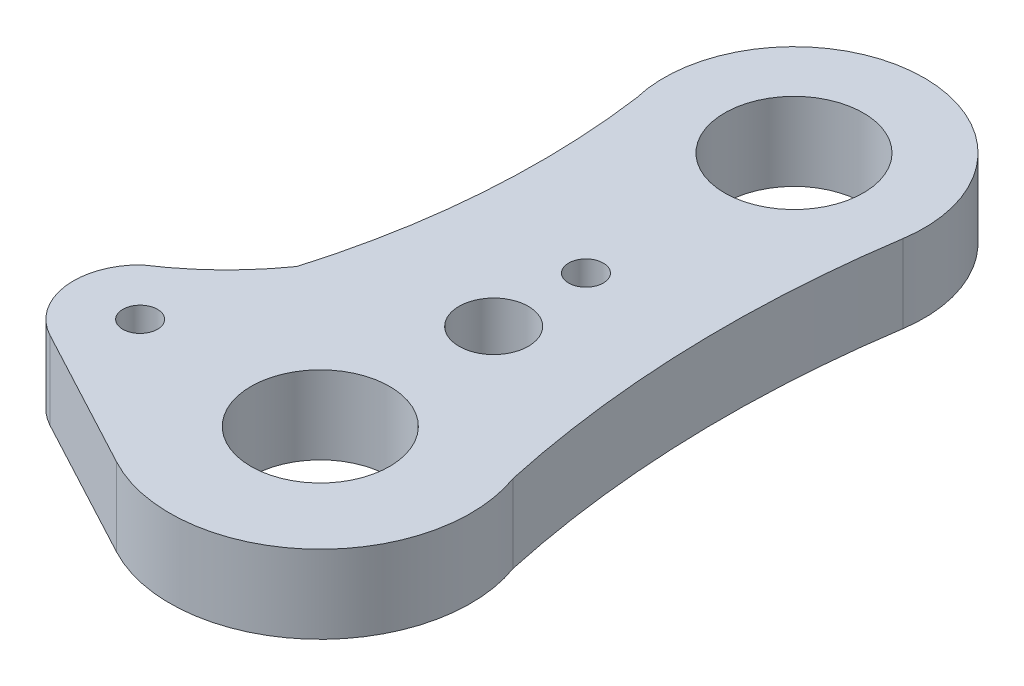
ISO-10303-21;
HEADER;
FILE_DESCRIPTION(('STEP AP214'),'2;1');
FILE_NAME('part.step','',(''),(''),'','','');
FILE_SCHEMA(('AUTOMOTIVE_DESIGN { 1 0 10303 214 1 1 1 1 }'));
ENDSEC;
DATA;
#1=APPLICATION_CONTEXT('core data for automotive mechanical design processes');
#2=APPLICATION_PROTOCOL_DEFINITION('international standard','automotive_design',2000,#1);
#3=PRODUCT_CONTEXT('',#1,'mechanical');
#4=PRODUCT('Part','Part','',(#3));
#5=PRODUCT_RELATED_PRODUCT_CATEGORY('part','',(#4));
#6=PRODUCT_DEFINITION_FORMATION('','',#4);
#7=PRODUCT_DEFINITION_CONTEXT('part definition',#1,'design');
#8=PRODUCT_DEFINITION('design','',#6,#7);
#9=PRODUCT_DEFINITION_SHAPE('','',#8);
#10=(LENGTH_UNIT() NAMED_UNIT(*) SI_UNIT(.MILLI.,.METRE.));
#11=(NAMED_UNIT(*) PLANE_ANGLE_UNIT() SI_UNIT($,.RADIAN.));
#12=(NAMED_UNIT(*) SI_UNIT($,.STERADIAN.) SOLID_ANGLE_UNIT());
#13=UNCERTAINTY_MEASURE_WITH_UNIT(LENGTH_MEASURE(1.E-05),#10,'distance_accuracy_value','');
#14=(GEOMETRIC_REPRESENTATION_CONTEXT(3) GLOBAL_UNCERTAINTY_ASSIGNED_CONTEXT((#13)) GLOBAL_UNIT_ASSIGNED_CONTEXT((#10,
#11,#12)) REPRESENTATION_CONTEXT('',''));
#15=CARTESIAN_POINT('',(0.,0.,0.));
#16=DIRECTION('',(0.,0.,1.));
#17=DIRECTION('',(1.,0.,0.));
#18=AXIS2_PLACEMENT_3D('',#15,#16,#17);
#19=CARTESIAN_POINT('',(-3.02396756935756E-08,4.5,-12.));
#20=DIRECTION('',(0.,-1.,0.));
#21=DIRECTION('',(0.,0.,-1.));
#22=AXIS2_PLACEMENT_3D('',#19,#20,#21);
#23=CYLINDRICAL_SURFACE('',#22,7.50754929042045);
#24=CARTESIAN_POINT('',(-3.02396756935756E-08,0.,-12.));
#25=DIRECTION('',(0.,1.,0.));
#26=DIRECTION('',(0.,0.,1.));
#27=AXIS2_PLACEMENT_3D('',#24,#25,#26);
#28=CIRCLE('',#27,7.50754929042045);
#29=CARTESIAN_POINT('',(7.41986360730751,0.,-10.8559196058416));
#30=VERTEX_POINT('',#29);
#31=CARTESIAN_POINT('',(-7.29353126921342,0.,-10.2201970855719));
#32=VERTEX_POINT('',#31);
#33=EDGE_CURVE('E147',#30,#32,#28,.T.);
#34=ORIENTED_EDGE('',*,*,#33,.T.);
#35=DIRECTION('',(0.,-1.,0.));
#36=VECTOR('',#35,1.);
#37=CARTESIAN_POINT('',(-7.29353126921342,4.5,-10.2201970855719));
#38=LINE('',#37,#36);
#39=CARTESIAN_POINT('',(-7.29353126921342,4.5,-10.2201970855719));
#40=VERTEX_POINT('',#39);
#41=EDGE_CURVE('E11',#40,#32,#38,.T.);
#42=ORIENTED_EDGE('',*,*,#41,.F.);
#43=CARTESIAN_POINT('',(-3.02396756935756E-08,4.5,-12.));
#44=DIRECTION('',(0.,1.,0.));
#45=DIRECTION('',(0.,0.,1.));
#46=AXIS2_PLACEMENT_3D('',#43,#44,#45);
#47=CIRCLE('',#46,7.50754929042045);
#48=CARTESIAN_POINT('',(7.41986360730751,4.5,-10.8559196058416));
#49=VERTEX_POINT('',#48);
#50=EDGE_CURVE('E195',#49,#40,#47,.T.);
#51=ORIENTED_EDGE('',*,*,#50,.F.);
#52=DIRECTION('',(0.,-1.,0.));
#53=VECTOR('',#52,1.);
#54=CARTESIAN_POINT('',(7.41986360730751,4.5,-10.8559196058416));
#55=LINE('',#54,#53);
#56=EDGE_CURVE('E56',#49,#30,#55,.T.);
#57=ORIENTED_EDGE('',*,*,#56,.T.);
#58=EDGE_LOOP('',(#34,#42,#51,#57));
#59=FACE_BOUND('',#58,.T.);
#60=ADVANCED_FACE('F39',(#59),#23,.T.);
#61=CARTESIAN_POINT('',(-50.2166583104749,4.5,-4.28021594673406));
#62=DIRECTION('',(0.,-1.,0.));
#63=DIRECTION('',(0.,0.,-1.));
#64=AXIS2_PLACEMENT_3D('',#61,#62,#63);
#65=CYLINDRICAL_SURFACE('',#64,43.3321844698606);
#66=CARTESIAN_POINT('',(-50.2166583104749,0.,-4.28021594673406));
#67=DIRECTION('',(0.,1.,0.));
#68=DIRECTION('',(0.,0.,1.));
#69=AXIS2_PLACEMENT_3D('',#66,#67,#68);
#70=CIRCLE('',#69,43.3321844698606);
#71=CARTESIAN_POINT('',(-8.66238724574874,0.,8.00476542115105));
#72=VERTEX_POINT('',#71);
#73=EDGE_CURVE('E149',#32,#72,#70,.F.);
#74=ORIENTED_EDGE('',*,*,#73,.T.);
#75=DIRECTION('',(0.,-1.,0.));
#76=VECTOR('',#75,1.);
#77=CARTESIAN_POINT('',(-8.66238724574874,4.5,8.00476542115105));
#78=LINE('',#77,#76);
#79=CARTESIAN_POINT('',(-8.66238724574874,4.5,8.00476542115105));
#80=VERTEX_POINT('',#79);
#81=EDGE_CURVE('E48',#80,#72,#78,.T.);
#82=ORIENTED_EDGE('',*,*,#81,.F.);
#83=CARTESIAN_POINT('',(-50.2166583104749,4.5,-4.28021594673406));
#84=DIRECTION('',(0.,1.,0.));
#85=DIRECTION('',(0.,0.,1.));
#86=AXIS2_PLACEMENT_3D('',#83,#84,#85);
#87=CIRCLE('',#86,43.3321844698606);
#88=EDGE_CURVE('E92',#40,#80,#87,.F.);
#89=ORIENTED_EDGE('',*,*,#88,.F.);
#90=ORIENTED_EDGE('',*,*,#41,.T.);
#91=EDGE_LOOP('',(#74,#82,#89,#90));
#92=FACE_BOUND('',#91,.T.);
#93=ADVANCED_FACE('F214',(#92),#65,.F.);
#94=CARTESIAN_POINT('',(-22.4440893784255,4.5,-1.72459310000654));
#95=DIRECTION('',(0.,-1.,0.));
#96=DIRECTION('',(0.,0.,-1.));
#97=AXIS2_PLACEMENT_3D('',#94,#95,#96);
#98=CYLINDRICAL_SURFACE('',#97,16.8699653499066);
#99=CARTESIAN_POINT('',(-22.4440893784255,0.,-1.72459310000654));
#100=DIRECTION('',(0.,1.,0.));
#101=DIRECTION('',(0.,0.,1.));
#102=AXIS2_PLACEMENT_3D('',#99,#100,#101);
#103=CIRCLE('',#102,16.8699653499066);
#104=CARTESIAN_POINT('',(-13.2165770675901,0.,12.3980393550434));
#105=VERTEX_POINT('',#104);
#106=EDGE_CURVE('E151',#72,#105,#103,.F.);
#107=ORIENTED_EDGE('',*,*,#106,.T.);
#108=DIRECTION('',(0.,-1.,0.));
#109=VECTOR('',#108,1.);
#110=CARTESIAN_POINT('',(-13.2165770675901,4.5,12.3980393550434));
#111=LINE('',#110,#109);
#112=CARTESIAN_POINT('',(-13.2165770675901,4.5,12.3980393550434));
#113=VERTEX_POINT('',#112);
#114=EDGE_CURVE('E177',#113,#105,#111,.T.);
#115=ORIENTED_EDGE('',*,*,#114,.F.);
#116=CARTESIAN_POINT('',(-22.4440893784255,4.5,-1.72459310000654));
#117=DIRECTION('',(0.,1.,0.));
#118=DIRECTION('',(0.,0.,1.));
#119=AXIS2_PLACEMENT_3D('',#116,#117,#118);
#120=CIRCLE('',#119,16.8699653499066);
#121=EDGE_CURVE('E185',#80,#113,#120,.F.);
#122=ORIENTED_EDGE('',*,*,#121,.F.);
#123=ORIENTED_EDGE('',*,*,#81,.T.);
#124=EDGE_LOOP('',(#107,#115,#122,#123));
#125=FACE_BOUND('',#124,.T.);
#126=ADVANCED_FACE('F183',(#125),#98,.F.);
#127=CARTESIAN_POINT('',(-10.5464293968531,4.5,15.1659886689218));
#128=DIRECTION('',(0.,-1.,0.));
#129=DIRECTION('',(0.,0.,-1.));
#130=AXIS2_PLACEMENT_3D('',#127,#128,#129);
#131=CYLINDRICAL_SURFACE('',#130,3.84593707537472);
#132=CARTESIAN_POINT('',(-10.5464293968531,0.,15.1659886689218));
#133=DIRECTION('',(0.,1.,0.));
#134=DIRECTION('',(0.,0.,1.));
#135=AXIS2_PLACEMENT_3D('',#132,#133,#134);
#136=CIRCLE('',#135,3.84593707537472);
#137=CARTESIAN_POINT('',(-12.3585468539113,0.,18.558253739574));
#138=VERTEX_POINT('',#137);
#139=EDGE_CURVE('E153',#105,#138,#136,.T.);
#140=ORIENTED_EDGE('',*,*,#139,.T.);
#141=DIRECTION('',(0.,-1.,0.));
#142=VECTOR('',#141,1.);
#143=CARTESIAN_POINT('',(-12.3585468539113,4.5,18.558253739574));
#144=LINE('',#143,#142);
#145=CARTESIAN_POINT('',(-12.3585468539113,4.5,18.558253739574));
#146=VERTEX_POINT('',#145);
#147=EDGE_CURVE('E124',#146,#138,#144,.T.);
#148=ORIENTED_EDGE('',*,*,#147,.F.);
#149=CARTESIAN_POINT('',(-10.5464293968531,4.5,15.1659886689218));
#150=DIRECTION('',(0.,1.,0.));
#151=DIRECTION('',(0.,0.,1.));
#152=AXIS2_PLACEMENT_3D('',#149,#150,#151);
#153=CIRCLE('',#152,3.84593707537472);
#154=EDGE_CURVE('E112',#113,#146,#153,.T.);
#155=ORIENTED_EDGE('',*,*,#154,.F.);
#156=ORIENTED_EDGE('',*,*,#114,.T.);
#157=EDGE_LOOP('',(#140,#148,#155,#156));
#158=FACE_BOUND('',#157,.T.);
#159=ADVANCED_FACE('F191',(#158),#131,.T.);
#160=CARTESIAN_POINT('',(-10.4564379002568,4.5,19.5743432161788));
#161=DIRECTION('',(0.471177094565849,0.,-0.882038630421868));
#162=DIRECTION('',(-0.882038630421868,0.,-0.471177094565849));
#163=AXIS2_PLACEMENT_3D('',#160,#161,#162);
#164=PLANE('',#163);
#165=DIRECTION('',(0.882038630421868,0.,0.471177094565849));
#166=VECTOR('',#165,1.);
#167=CARTESIAN_POINT('',(-10.4564379002568,0.,19.5743432161788));
#168=LINE('',#167,#166);
#169=CARTESIAN_POINT('',(-4.08907985763475,0.,22.9757285513633));
#170=VERTEX_POINT('',#169);
#171=EDGE_CURVE('E121',#138,#170,#168,.T.);
#172=ORIENTED_EDGE('',*,*,#171,.T.);
#173=DIRECTION('',(0.,-1.,0.));
#174=VECTOR('',#173,1.);
#175=CARTESIAN_POINT('',(-4.08907985763475,4.5,22.9757285513633));
#176=LINE('',#175,#174);
#177=CARTESIAN_POINT('',(-4.08907985763475,4.5,22.9757285513633));
#178=VERTEX_POINT('',#177);
#179=EDGE_CURVE('E118',#178,#170,#176,.T.);
#180=ORIENTED_EDGE('',*,*,#179,.F.);
#181=DIRECTION('',(0.882038630421868,0.,0.471177094565849));
#182=VECTOR('',#181,1.);
#183=CARTESIAN_POINT('',(-10.4564379002568,4.5,19.5743432161788));
#184=LINE('',#183,#182);
#185=EDGE_CURVE('E104',#146,#178,#184,.T.);
#186=ORIENTED_EDGE('',*,*,#185,.F.);
#187=ORIENTED_EDGE('',*,*,#147,.T.);
#188=EDGE_LOOP('',(#172,#180,#186,#187));
#189=FACE_BOUND('',#188,.T.);
#190=ADVANCED_FACE('F119',(#189),#164,.F.);
#191=CARTESIAN_POINT('',(0.,4.5,15.3210135006727));
#192=DIRECTION('',(0.,-1.,0.));
#193=DIRECTION('',(0.,0.,-1.));
#194=AXIS2_PLACEMENT_3D('',#191,#192,#193);
#195=CYLINDRICAL_SURFACE('',#194,8.67843514634897);
#196=CARTESIAN_POINT('',(0.,0.,15.3210135006727));
#197=DIRECTION('',(0.,1.,0.));
#198=DIRECTION('',(0.,0.,1.));
#199=AXIS2_PLACEMENT_3D('',#196,#197,#198);
#200=CIRCLE('',#199,8.67843514634897);
#201=CARTESIAN_POINT('',(8.15451799816649,0.,12.3513211248594));
#202=VERTEX_POINT('',#201);
#203=EDGE_CURVE('E156',#170,#202,#200,.T.);
#204=ORIENTED_EDGE('',*,*,#203,.T.);
#205=DIRECTION('',(0.,-1.,0.));
#206=VECTOR('',#205,1.);
#207=CARTESIAN_POINT('',(8.15451799816649,4.5,12.3513211248594));
#208=LINE('',#207,#206);
#209=CARTESIAN_POINT('',(8.15451799816649,4.5,12.3513211248594));
#210=VERTEX_POINT('',#209);
#211=EDGE_CURVE('E80',#210,#202,#208,.T.);
#212=ORIENTED_EDGE('',*,*,#211,.F.);
#213=CARTESIAN_POINT('',(0.,4.5,15.3210135006727));
#214=DIRECTION('',(0.,1.,0.));
#215=DIRECTION('',(0.,0.,1.));
#216=AXIS2_PLACEMENT_3D('',#213,#214,#215);
#217=CIRCLE('',#216,8.67843514634897);
#218=EDGE_CURVE('E110',#178,#210,#217,.T.);
#219=ORIENTED_EDGE('',*,*,#218,.F.);
#220=ORIENTED_EDGE('',*,*,#179,.T.);
#221=EDGE_LOOP('',(#204,#212,#219,#220));
#222=FACE_BOUND('',#221,.T.);
#223=ADVANCED_FACE('F126',(#222),#195,.T.);
#224=CARTESIAN_POINT('',(-10.5464293968531,4.5,15.1659886689218));
#225=DIRECTION('',(0.,-1.,0.));
#226=DIRECTION('',(0.,0.,-1.));
#227=AXIS2_PLACEMENT_3D('',#224,#225,#226);
#228=CYLINDRICAL_SURFACE('',#227,0.999999999999999);
#229=CARTESIAN_POINT('',(-10.5464293968531,4.5,15.1659886689218));
#230=DIRECTION('',(0.,1.,0.));
#231=DIRECTION('',(0.,0.,1.));
#232=AXIS2_PLACEMENT_3D('',#229,#230,#231);
#233=CIRCLE('',#232,0.999999999999999);
#234=CARTESIAN_POINT('',(-10.5464293968531,4.5,16.1659886689218));
#235=VERTEX_POINT('',#234);
#236=EDGE_CURVE('E138',#235,#235,#233,.T.);
#237=ORIENTED_EDGE('',*,*,#236,.T.);
#238=EDGE_LOOP('',(#237));
#239=FACE_BOUND('',#238,.T.);
#240=CARTESIAN_POINT('',(-10.5464293968531,0.,15.1659886689218));
#241=DIRECTION('',(0.,1.,0.));
#242=DIRECTION('',(0.,0.,1.));
#243=AXIS2_PLACEMENT_3D('',#240,#241,#242);
#244=CIRCLE('',#243,0.999999999999999);
#245=CARTESIAN_POINT('',(-10.5464293968531,0.,16.1659886689218));
#246=VERTEX_POINT('',#245);
#247=EDGE_CURVE('E167',#246,#246,#244,.T.);
#248=ORIENTED_EDGE('',*,*,#247,.F.);
#249=EDGE_LOOP('',(#248));
#250=FACE_BOUND('',#249,.T.);
#251=ADVANCED_FACE('F228',(#239,#250),#228,.F.);
#252=CARTESIAN_POINT('',(0.,4.5,15.3210135006727));
#253=DIRECTION('',(0.,-1.,0.));
#254=DIRECTION('',(0.,0.,-1.));
#255=AXIS2_PLACEMENT_3D('',#252,#253,#254);
#256=CYLINDRICAL_SURFACE('',#255,4.);
#257=CARTESIAN_POINT('',(0.,4.5,15.3210135006727));
#258=DIRECTION('',(0.,1.,0.));
#259=DIRECTION('',(0.,0.,1.));
#260=AXIS2_PLACEMENT_3D('',#257,#258,#259);
#261=CIRCLE('',#260,4.);
#262=CARTESIAN_POINT('',(0.,4.5,19.3210135006727));
#263=VERTEX_POINT('',#262);
#264=EDGE_CURVE('E135',#263,#263,#261,.T.);
#265=ORIENTED_EDGE('',*,*,#264,.T.);
#266=EDGE_LOOP('',(#265));
#267=FACE_BOUND('',#266,.T.);
#268=CARTESIAN_POINT('',(0.,0.,15.3210135006727));
#269=DIRECTION('',(0.,1.,0.));
#270=DIRECTION('',(0.,0.,1.));
#271=AXIS2_PLACEMENT_3D('',#268,#269,#270);
#272=CIRCLE('',#271,4.);
#273=CARTESIAN_POINT('',(0.,0.,19.3210135006727));
#274=VERTEX_POINT('',#273);
#275=EDGE_CURVE('E164',#274,#274,#272,.T.);
#276=ORIENTED_EDGE('',*,*,#275,.F.);
#277=EDGE_LOOP('',(#276));
#278=FACE_BOUND('',#277,.T.);
#279=ADVANCED_FACE('F235',(#267,#278),#256,.F.);
#280=CARTESIAN_POINT('',(0.,4.5,5.32101350067268));
#281=DIRECTION('',(0.,-1.,0.));
#282=DIRECTION('',(0.,0.,-1.));
#283=AXIS2_PLACEMENT_3D('',#280,#281,#282);
#284=CYLINDRICAL_SURFACE('',#283,2.);
#285=CARTESIAN_POINT('',(0.,4.5,5.32101350067268));
#286=DIRECTION('',(0.,1.,0.));
#287=DIRECTION('',(0.,0.,1.));
#288=AXIS2_PLACEMENT_3D('',#285,#286,#287);
#289=CIRCLE('',#288,2.);
#290=CARTESIAN_POINT('',(0.,4.5,7.32101350067268));
#291=VERTEX_POINT('',#290);
#292=EDGE_CURVE('E129',#291,#291,#289,.T.);
#293=ORIENTED_EDGE('',*,*,#292,.T.);
#294=EDGE_LOOP('',(#293));
#295=FACE_BOUND('',#294,.T.);
#296=CARTESIAN_POINT('',(0.,0.,5.32101350067268));
#297=DIRECTION('',(0.,1.,0.));
#298=DIRECTION('',(0.,0.,1.));
#299=AXIS2_PLACEMENT_3D('',#296,#297,#298);
#300=CIRCLE('',#299,2.);
#301=CARTESIAN_POINT('',(0.,0.,7.32101350067268));
#302=VERTEX_POINT('',#301);
#303=EDGE_CURVE('E161',#302,#302,#300,.T.);
#304=ORIENTED_EDGE('',*,*,#303,.F.);
#305=EDGE_LOOP('',(#304));
#306=FACE_BOUND('',#305,.T.);
#307=ADVANCED_FACE('F232',(#295,#306),#284,.F.);
#308=CARTESIAN_POINT('',(70.6175087739615,4.5,-1.24127197155634));
#309=DIRECTION('',(0.,-1.,0.));
#310=DIRECTION('',(0.,0.,-1.));
#311=AXIS2_PLACEMENT_3D('',#308,#309,#310);
#312=CYLINDRICAL_SURFACE('',#311,63.9248293211783);
#313=CARTESIAN_POINT('',(70.6175087739615,0.,-1.24127197155634));
#314=DIRECTION('',(0.,1.,0.));
#315=DIRECTION('',(0.,0.,1.));
#316=AXIS2_PLACEMENT_3D('',#313,#314,#315);
#317=CIRCLE('',#316,63.9248293211783);
#318=EDGE_CURVE('E158',#30,#202,#317,.T.);
#319=ORIENTED_EDGE('',*,*,#318,.F.);
#320=ORIENTED_EDGE('',*,*,#56,.F.);
#321=CARTESIAN_POINT('',(70.6175087739615,4.5,-1.24127197155634));
#322=DIRECTION('',(0.,1.,0.));
#323=DIRECTION('',(0.,0.,1.));
#324=AXIS2_PLACEMENT_3D('',#321,#322,#323);
#325=CIRCLE('',#324,63.9248293211783);
#326=EDGE_CURVE('E127',#49,#210,#325,.T.);
#327=ORIENTED_EDGE('',*,*,#326,.T.);
#328=ORIENTED_EDGE('',*,*,#211,.T.);
#329=EDGE_LOOP('',(#319,#320,#327,#328));
#330=FACE_BOUND('',#329,.T.);
#331=ADVANCED_FACE('F229',(#330),#312,.F.);
#332=CARTESIAN_POINT('',(0.,4.5,0.));
#333=DIRECTION('',(0.,-1.,0.));
#334=DIRECTION('',(0.,0.,-1.));
#335=AXIS2_PLACEMENT_3D('',#332,#333,#334);
#336=CYLINDRICAL_SURFACE('',#335,1.);
#337=CARTESIAN_POINT('',(0.,4.5,0.));
#338=DIRECTION('',(0.,1.,0.));
#339=DIRECTION('',(0.,0.,1.));
#340=AXIS2_PLACEMENT_3D('',#337,#338,#339);
#341=CIRCLE('',#340,1.);
#342=CARTESIAN_POINT('',(0.,4.5,1.));
#343=VERTEX_POINT('',#342);
#344=EDGE_CURVE('E173',#343,#343,#341,.T.);
#345=ORIENTED_EDGE('',*,*,#344,.T.);
#346=EDGE_LOOP('',(#345));
#347=FACE_BOUND('',#346,.T.);
#348=CARTESIAN_POINT('',(0.,0.,0.));
#349=DIRECTION('',(0.,1.,0.));
#350=DIRECTION('',(0.,0.,1.));
#351=AXIS2_PLACEMENT_3D('',#348,#349,#350);
#352=CIRCLE('',#351,1.);
#353=CARTESIAN_POINT('',(0.,0.,1.));
#354=VERTEX_POINT('',#353);
#355=EDGE_CURVE('E144',#354,#354,#352,.T.);
#356=ORIENTED_EDGE('',*,*,#355,.F.);
#357=EDGE_LOOP('',(#356));
#358=FACE_BOUND('',#357,.T.);
#359=ADVANCED_FACE('F41',(#347,#358),#336,.F.);
#360=CARTESIAN_POINT('',(-3.02396756935756E-08,4.5,-12.));
#361=DIRECTION('',(0.,-1.,0.));
#362=DIRECTION('',(0.,0.,-1.));
#363=AXIS2_PLACEMENT_3D('',#360,#361,#362);
#364=CYLINDRICAL_SURFACE('',#363,4.);
#365=CARTESIAN_POINT('',(-3.02396756935756E-08,4.5,-12.));
#366=DIRECTION('',(0.,1.,0.));
#367=DIRECTION('',(0.,0.,1.));
#368=AXIS2_PLACEMENT_3D('',#365,#366,#367);
#369=CIRCLE('',#368,4.);
#370=CARTESIAN_POINT('',(-3.02396756935756E-08,4.5,-8.));
#371=VERTEX_POINT('',#370);
#372=EDGE_CURVE('E141',#371,#371,#369,.T.);
#373=ORIENTED_EDGE('',*,*,#372,.T.);
#374=EDGE_LOOP('',(#373));
#375=FACE_BOUND('',#374,.T.);
#376=CARTESIAN_POINT('',(-3.02396756935756E-08,0.,-12.));
#377=DIRECTION('',(0.,1.,0.));
#378=DIRECTION('',(0.,0.,1.));
#379=AXIS2_PLACEMENT_3D('',#376,#377,#378);
#380=CIRCLE('',#379,4.);
#381=CARTESIAN_POINT('',(-3.02396756935756E-08,0.,-8.));
#382=VERTEX_POINT('',#381);
#383=EDGE_CURVE('E170',#382,#382,#380,.T.);
#384=ORIENTED_EDGE('',*,*,#383,.F.);
#385=EDGE_LOOP('',(#384));
#386=FACE_BOUND('',#385,.T.);
#387=ADVANCED_FACE('F203',(#375,#386),#364,.F.);
#388=CARTESIAN_POINT('',(0.,4.5,0.));
#389=DIRECTION('',(0.,1.,0.));
#390=DIRECTION('',(0.,0.,1.));
#391=AXIS2_PLACEMENT_3D('',#388,#389,#390);
#392=PLANE('',#391);
#393=ORIENTED_EDGE('',*,*,#344,.F.);
#394=EDGE_LOOP('',(#393));
#395=FACE_BOUND('',#394,.T.);
#396=ORIENTED_EDGE('',*,*,#50,.T.);
#397=ORIENTED_EDGE('',*,*,#88,.T.);
#398=ORIENTED_EDGE('',*,*,#121,.T.);
#399=ORIENTED_EDGE('',*,*,#154,.T.);
#400=ORIENTED_EDGE('',*,*,#185,.T.);
#401=ORIENTED_EDGE('',*,*,#218,.T.);
#402=ORIENTED_EDGE('',*,*,#326,.F.);
#403=EDGE_LOOP('',(#396,#397,#398,#399,#400,#401,#402));
#404=FACE_BOUND('',#403,.T.);
#405=ORIENTED_EDGE('',*,*,#292,.F.);
#406=EDGE_LOOP('',(#405));
#407=FACE_BOUND('',#406,.T.);
#408=ORIENTED_EDGE('',*,*,#264,.F.);
#409=EDGE_LOOP('',(#408));
#410=FACE_BOUND('',#409,.T.);
#411=ORIENTED_EDGE('',*,*,#236,.F.);
#412=EDGE_LOOP('',(#411));
#413=FACE_BOUND('',#412,.T.);
#414=ORIENTED_EDGE('',*,*,#372,.F.);
#415=EDGE_LOOP('',(#414));
#416=FACE_BOUND('',#415,.T.);
#417=ADVANCED_FACE('F106',(#395,#404,#407,#410,#413,#416),#392,.T.);
#418=CARTESIAN_POINT('',(0.,0.,0.));
#419=DIRECTION('',(0.,1.,0.));
#420=DIRECTION('',(0.,0.,1.));
#421=AXIS2_PLACEMENT_3D('',#418,#419,#420);
#422=PLANE('',#421);
#423=ORIENTED_EDGE('',*,*,#355,.T.);
#424=EDGE_LOOP('',(#423));
#425=FACE_BOUND('',#424,.T.);
#426=ORIENTED_EDGE('',*,*,#33,.F.);
#427=ORIENTED_EDGE('',*,*,#318,.T.);
#428=ORIENTED_EDGE('',*,*,#203,.F.);
#429=ORIENTED_EDGE('',*,*,#171,.F.);
#430=ORIENTED_EDGE('',*,*,#139,.F.);
#431=ORIENTED_EDGE('',*,*,#106,.F.);
#432=ORIENTED_EDGE('',*,*,#73,.F.);
#433=EDGE_LOOP('',(#426,#427,#428,#429,#430,#431,#432));
#434=FACE_BOUND('',#433,.T.);
#435=ORIENTED_EDGE('',*,*,#303,.T.);
#436=EDGE_LOOP('',(#435));
#437=FACE_BOUND('',#436,.T.);
#438=ORIENTED_EDGE('',*,*,#275,.T.);
#439=EDGE_LOOP('',(#438));
#440=FACE_BOUND('',#439,.T.);
#441=ORIENTED_EDGE('',*,*,#247,.T.);
#442=EDGE_LOOP('',(#441));
#443=FACE_BOUND('',#442,.T.);
#444=ORIENTED_EDGE('',*,*,#383,.T.);
#445=EDGE_LOOP('',(#444));
#446=FACE_BOUND('',#445,.T.);
#447=ADVANCED_FACE('F188',(#425,#434,#437,#440,#443,#446),#422,.F.);
#448=CLOSED_SHELL('',(#60,#93,#126,#159,#190,#223,#251,#279,#307,#331,#359,#387,#417,#447));
#449=MANIFOLD_SOLID_BREP('B2',#448);
#450=ADVANCED_BREP_SHAPE_REPRESENTATION('',(#18,#449),#14);
#451=SHAPE_DEFINITION_REPRESENTATION(#9,#450);
ENDSEC;
END-ISO-10303-21;
